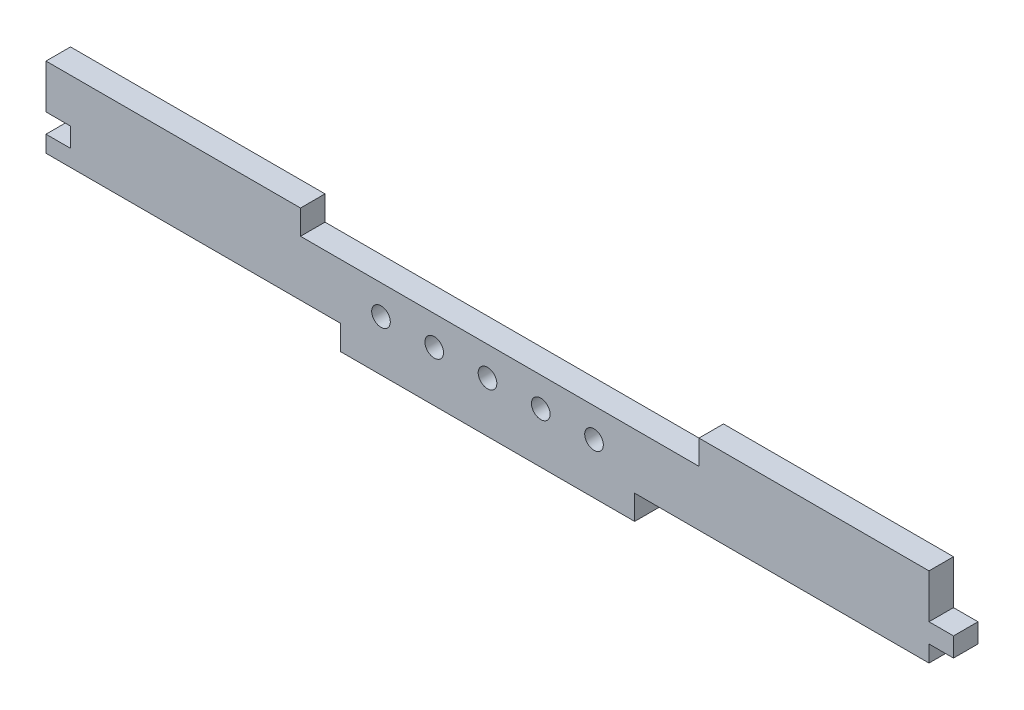
ISO-10303-21;
HEADER;
FILE_DESCRIPTION(('STEP AP214'),'2;1');
FILE_NAME('part.step','',(''),(''),'','','');
FILE_SCHEMA(('AUTOMOTIVE_DESIGN { 1 0 10303 214 1 1 1 1 }'));
ENDSEC;
DATA;
#1=APPLICATION_CONTEXT('core data for automotive mechanical design processes');
#2=APPLICATION_PROTOCOL_DEFINITION('international standard','automotive_design',2000,#1);
#3=PRODUCT_CONTEXT('',#1,'mechanical');
#4=PRODUCT('Part','Part','',(#3));
#5=PRODUCT_RELATED_PRODUCT_CATEGORY('part','',(#4));
#6=PRODUCT_DEFINITION_FORMATION('','',#4);
#7=PRODUCT_DEFINITION_CONTEXT('part definition',#1,'design');
#8=PRODUCT_DEFINITION('design','',#6,#7);
#9=PRODUCT_DEFINITION_SHAPE('','',#8);
#10=(LENGTH_UNIT() NAMED_UNIT(*) SI_UNIT(.MILLI.,.METRE.));
#11=(NAMED_UNIT(*) PLANE_ANGLE_UNIT() SI_UNIT($,.RADIAN.));
#12=(NAMED_UNIT(*) SI_UNIT($,.STERADIAN.) SOLID_ANGLE_UNIT());
#13=UNCERTAINTY_MEASURE_WITH_UNIT(LENGTH_MEASURE(1.E-05),#10,'distance_accuracy_value','');
#14=(GEOMETRIC_REPRESENTATION_CONTEXT(3) GLOBAL_UNCERTAINTY_ASSIGNED_CONTEXT((#13)) GLOBAL_UNIT_ASSIGNED_CONTEXT((#10,
#11,#12)) REPRESENTATION_CONTEXT('',''));
#15=CARTESIAN_POINT('',(0.,0.,0.));
#16=DIRECTION('',(0.,0.,1.));
#17=DIRECTION('',(1.,0.,0.));
#18=AXIS2_PLACEMENT_3D('',#15,#16,#17);
#19=CARTESIAN_POINT('',(0.,15.,4.6));
#20=DIRECTION('',(0.,-1.,0.));
#21=DIRECTION('',(0.,0.,-1.));
#22=AXIS2_PLACEMENT_3D('',#19,#20,#21);
#23=PLANE('',#22);
#24=DIRECTION('',(0.,0.,-1.));
#25=VECTOR('',#24,1.);
#26=CARTESIAN_POINT('',(47.7913014648267,15.,-1.55431223447522E-12));
#27=LINE('',#26,#25);
#28=CARTESIAN_POINT('',(47.7913014648267,15.,4.59999999999847));
#29=VERTEX_POINT('',#28);
#30=CARTESIAN_POINT('',(47.7913014648267,15.,-1.55431223447522E-12));
#31=VERTEX_POINT('',#30);
#32=EDGE_CURVE('E360',#29,#31,#27,.T.);
#33=ORIENTED_EDGE('',*,*,#32,.T.);
#34=DIRECTION('',(-1.,0.,0.));
#35=VECTOR('',#34,1.);
#36=CARTESIAN_POINT('',(0.,15.,0.));
#37=LINE('',#36,#35);
#38=CARTESIAN_POINT('',(0.,15.,0.));
#39=VERTEX_POINT('',#38);
#40=EDGE_CURVE('E214',#31,#39,#37,.T.);
#41=ORIENTED_EDGE('',*,*,#40,.T.);
#42=DIRECTION('',(0.,0.,-1.));
#43=VECTOR('',#42,1.);
#44=CARTESIAN_POINT('',(0.,15.,4.6));
#45=LINE('',#44,#43);
#46=CARTESIAN_POINT('',(0.,15.,4.6));
#47=VERTEX_POINT('',#46);
#48=EDGE_CURVE('E228',#47,#39,#45,.T.);
#49=ORIENTED_EDGE('',*,*,#48,.F.);
#50=DIRECTION('',(-1.,0.,0.));
#51=VECTOR('',#50,1.);
#52=CARTESIAN_POINT('',(0.,15.,4.6));
#53=LINE('',#52,#51);
#54=EDGE_CURVE('E301',#29,#47,#53,.T.);
#55=ORIENTED_EDGE('',*,*,#54,.F.);
#56=EDGE_LOOP('',(#33,#41,#49,#55));
#57=FACE_BOUND('',#56,.T.);
#58=ADVANCED_FACE('F31',(#57),#23,.F.);
#59=DIRECTION('',(0.,0.,1.));
#60=VECTOR('',#59,1.);
#61=CARTESIAN_POINT('',(122.608698535174,15.,-1.02695629777827E-12));
#62=LINE('',#61,#60);
#63=CARTESIAN_POINT('',(122.608698535174,15.,0.));
#64=VERTEX_POINT('',#63);
#65=CARTESIAN_POINT('',(122.608698535174,15.,4.59999999999897));
#66=VERTEX_POINT('',#65);
#67=EDGE_CURVE('E46',#64,#66,#62,.T.);
#68=ORIENTED_EDGE('',*,*,#67,.T.);
#69=CARTESIAN_POINT('',(165.8,15.,4.6));
#70=VERTEX_POINT('',#69);
#71=EDGE_CURVE('E302',#70,#66,#53,.T.);
#72=ORIENTED_EDGE('',*,*,#71,.F.);
#73=DIRECTION('',(0.,0.,-1.));
#74=VECTOR('',#73,1.);
#75=CARTESIAN_POINT('',(165.8,15.,4.6));
#76=LINE('',#75,#74);
#77=CARTESIAN_POINT('',(165.8,15.,0.));
#78=VERTEX_POINT('',#77);
#79=EDGE_CURVE('E231',#70,#78,#76,.T.);
#80=ORIENTED_EDGE('',*,*,#79,.T.);
#81=EDGE_CURVE('E215',#78,#64,#37,.T.);
#82=ORIENTED_EDGE('',*,*,#81,.T.);
#83=EDGE_LOOP('',(#68,#72,#80,#82));
#84=FACE_BOUND('',#83,.T.);
#85=ADVANCED_FACE('F390',(#84),#23,.F.);
#86=CARTESIAN_POINT('',(0.,3.10839082158942,4.6));
#87=DIRECTION('',(0.,0.,-1.));
#88=DIRECTION('',(-1.,0.,0.));
#89=AXIS2_PLACEMENT_3D('',#86,#87,#88);
#90=PLANE('',#89);
#91=CARTESIAN_POINT('',(62.9,4.9,4.6));
#92=DIRECTION('',(0.,0.,-1.));
#93=DIRECTION('',(-1.,0.,0.));
#94=AXIS2_PLACEMENT_3D('',#91,#92,#93);
#95=CIRCLE('',#94,1.75);
#96=CARTESIAN_POINT('',(61.15,4.9,4.6));
#97=VERTEX_POINT('',#96);
#98=EDGE_CURVE('E194',#97,#97,#95,.T.);
#99=ORIENTED_EDGE('',*,*,#98,.T.);
#100=EDGE_LOOP('',(#99));
#101=FACE_BOUND('',#100,.T.);
#102=CARTESIAN_POINT('',(102.9,4.89999999999986,4.6));
#103=DIRECTION('',(0.,0.,-1.));
#104=DIRECTION('',(-1.,0.,0.));
#105=AXIS2_PLACEMENT_3D('',#102,#103,#104);
#106=CIRCLE('',#105,1.75);
#107=CARTESIAN_POINT('',(101.15,4.89999999999986,4.6));
#108=VERTEX_POINT('',#107);
#109=EDGE_CURVE('E325',#108,#108,#106,.T.);
#110=ORIENTED_EDGE('',*,*,#109,.T.);
#111=EDGE_LOOP('',(#110));
#112=FACE_BOUND('',#111,.T.);
#113=CARTESIAN_POINT('',(82.9,4.9,4.6));
#114=DIRECTION('',(0.,0.,-1.));
#115=DIRECTION('',(-1.,0.,0.));
#116=AXIS2_PLACEMENT_3D('',#113,#114,#115);
#117=CIRCLE('',#116,1.75);
#118=CARTESIAN_POINT('',(81.15,4.9,4.6));
#119=VERTEX_POINT('',#118);
#120=EDGE_CURVE('E331',#119,#119,#117,.T.);
#121=ORIENTED_EDGE('',*,*,#120,.T.);
#122=EDGE_LOOP('',(#121));
#123=FACE_BOUND('',#122,.T.);
#124=CARTESIAN_POINT('',(72.9,4.9,4.6));
#125=DIRECTION('',(0.,0.,-1.));
#126=DIRECTION('',(-1.,0.,0.));
#127=AXIS2_PLACEMENT_3D('',#124,#125,#126);
#128=CIRCLE('',#127,1.75);
#129=CARTESIAN_POINT('',(71.15,4.9,4.6));
#130=VERTEX_POINT('',#129);
#131=EDGE_CURVE('E337',#130,#130,#128,.T.);
#132=ORIENTED_EDGE('',*,*,#131,.T.);
#133=EDGE_LOOP('',(#132));
#134=FACE_BOUND('',#133,.T.);
#135=CARTESIAN_POINT('',(92.9,4.89999999999993,4.6));
#136=DIRECTION('',(0.,0.,-1.));
#137=DIRECTION('',(-1.,0.,0.));
#138=AXIS2_PLACEMENT_3D('',#135,#136,#137);
#139=CIRCLE('',#138,1.75);
#140=CARTESIAN_POINT('',(91.15,4.89999999999993,4.6));
#141=VERTEX_POINT('',#140);
#142=EDGE_CURVE('E343',#141,#141,#139,.T.);
#143=ORIENTED_EDGE('',*,*,#142,.T.);
#144=EDGE_LOOP('',(#143));
#145=FACE_BOUND('',#144,.T.);
#146=DIRECTION('',(0.,1.,0.));
#147=VECTOR('',#146,1.);
#148=CARTESIAN_POINT('',(47.7913014648267,10.4,4.59999999999847));
#149=LINE('',#148,#147);
#150=CARTESIAN_POINT('',(47.7913014648267,10.4,4.59999999999847));
#151=VERTEX_POINT('',#150);
#152=EDGE_CURVE('E312',#151,#29,#149,.T.);
#153=ORIENTED_EDGE('',*,*,#152,.T.);
#154=ORIENTED_EDGE('',*,*,#54,.T.);
#155=DIRECTION('',(0.,-1.,0.));
#156=VECTOR('',#155,1.);
#157=CARTESIAN_POINT('',(0.,6.72272795381801,4.6));
#158=LINE('',#157,#156);
#159=CARTESIAN_POINT('',(0.,6.72272795381801,4.6));
#160=VERTEX_POINT('',#159);
#161=EDGE_CURVE('E169',#47,#160,#158,.T.);
#162=ORIENTED_EDGE('',*,*,#161,.T.);
#163=DIRECTION('',(1.,0.,0.));
#164=VECTOR('',#163,1.);
#165=CARTESIAN_POINT('',(0.,6.72272795381801,4.6));
#166=LINE('',#165,#164);
#167=CARTESIAN_POINT('',(4.6,6.72272795381801,4.6));
#168=VERTEX_POINT('',#167);
#169=EDGE_CURVE('E161',#160,#168,#166,.T.);
#170=ORIENTED_EDGE('',*,*,#169,.T.);
#171=DIRECTION('',(0.,-1.,0.));
#172=VECTOR('',#171,1.);
#173=CARTESIAN_POINT('',(4.6,3.10839082158942,4.6));
#174=LINE('',#173,#172);
#175=CARTESIAN_POINT('',(4.6,3.10839082158942,4.6));
#176=VERTEX_POINT('',#175);
#177=EDGE_CURVE('E166',#168,#176,#174,.T.);
#178=ORIENTED_EDGE('',*,*,#177,.T.);
#179=DIRECTION('',(-1.,0.,0.));
#180=VECTOR('',#179,1.);
#181=CARTESIAN_POINT('',(0.,3.10839082158942,4.6));
#182=LINE('',#181,#180);
#183=CARTESIAN_POINT('',(0.,3.10839082158942,4.6));
#184=VERTEX_POINT('',#183);
#185=EDGE_CURVE('E55',#176,#184,#182,.T.);
#186=ORIENTED_EDGE('',*,*,#185,.T.);
#187=DIRECTION('',(0.,-1.,0.));
#188=VECTOR('',#187,1.);
#189=CARTESIAN_POINT('',(0.,0.,4.6));
#190=LINE('',#189,#188);
#191=CARTESIAN_POINT('',(0.,0.,4.6));
#192=VERTEX_POINT('',#191);
#193=EDGE_CURVE('E224',#184,#192,#190,.T.);
#194=ORIENTED_EDGE('',*,*,#193,.T.);
#195=DIRECTION('',(1.,0.,0.));
#196=VECTOR('',#195,1.);
#197=CARTESIAN_POINT('',(0.,0.,4.6));
#198=LINE('',#197,#196);
#199=CARTESIAN_POINT('',(55.2666666666667,0.,4.6));
#200=VERTEX_POINT('',#199);
#201=EDGE_CURVE('E121',#192,#200,#198,.T.);
#202=ORIENTED_EDGE('',*,*,#201,.T.);
#203=DIRECTION('',(0.,-1.,0.));
#204=VECTOR('',#203,1.);
#205=CARTESIAN_POINT('',(55.2666666666667,0.,4.6));
#206=LINE('',#205,#204);
#207=CARTESIAN_POINT('',(55.2666666666667,-4.6,4.6));
#208=VERTEX_POINT('',#207);
#209=EDGE_CURVE('E283',#200,#208,#206,.T.);
#210=ORIENTED_EDGE('',*,*,#209,.T.);
#211=DIRECTION('',(1.,0.,0.));
#212=VECTOR('',#211,1.);
#213=CARTESIAN_POINT('',(55.2666666666667,-4.6,4.6));
#214=LINE('',#213,#212);
#215=CARTESIAN_POINT('',(110.533333333333,-4.6,4.6));
#216=VERTEX_POINT('',#215);
#217=EDGE_CURVE('E280',#208,#216,#214,.T.);
#218=ORIENTED_EDGE('',*,*,#217,.T.);
#219=DIRECTION('',(0.,1.,0.));
#220=VECTOR('',#219,1.);
#221=CARTESIAN_POINT('',(110.533333333333,0.,4.6));
#222=LINE('',#221,#220);
#223=CARTESIAN_POINT('',(110.533333333333,0.,4.6));
#224=VERTEX_POINT('',#223);
#225=EDGE_CURVE('E282',#216,#224,#222,.T.);
#226=ORIENTED_EDGE('',*,*,#225,.T.);
#227=DIRECTION('',(1.,0.,0.));
#228=VECTOR('',#227,1.);
#229=CARTESIAN_POINT('',(110.533333333333,0.,4.6));
#230=LINE('',#229,#228);
#231=CARTESIAN_POINT('',(165.8,0.,4.6));
#232=VERTEX_POINT('',#231);
#233=EDGE_CURVE('E285',#224,#232,#230,.T.);
#234=ORIENTED_EDGE('',*,*,#233,.T.);
#235=DIRECTION('',(0.,1.,0.));
#236=VECTOR('',#235,1.);
#237=CARTESIAN_POINT('',(165.8,0.,4.6));
#238=LINE('',#237,#236);
#239=CARTESIAN_POINT('',(165.8,3.10839082158942,4.6));
#240=VERTEX_POINT('',#239);
#241=EDGE_CURVE('E291',#232,#240,#238,.T.);
#242=ORIENTED_EDGE('',*,*,#241,.T.);
#243=DIRECTION('',(1.,0.,0.));
#244=VECTOR('',#243,1.);
#245=CARTESIAN_POINT('',(165.8,3.10839082158942,4.6));
#246=LINE('',#245,#244);
#247=CARTESIAN_POINT('',(170.4,3.10839082158942,4.6));
#248=VERTEX_POINT('',#247);
#249=EDGE_CURVE('E293',#240,#248,#246,.T.);
#250=ORIENTED_EDGE('',*,*,#249,.T.);
#251=DIRECTION('',(0.,1.,0.));
#252=VECTOR('',#251,1.);
#253=CARTESIAN_POINT('',(170.4,3.10839082158942,4.6));
#254=LINE('',#253,#252);
#255=CARTESIAN_POINT('',(170.4,6.72272795381801,4.6));
#256=VERTEX_POINT('',#255);
#257=EDGE_CURVE('E295',#248,#256,#254,.T.);
#258=ORIENTED_EDGE('',*,*,#257,.T.);
#259=DIRECTION('',(-1.,0.,0.));
#260=VECTOR('',#259,1.);
#261=CARTESIAN_POINT('',(165.8,6.72272795381801,4.6));
#262=LINE('',#261,#260);
#263=CARTESIAN_POINT('',(165.8,6.72272795381801,4.6));
#264=VERTEX_POINT('',#263);
#265=EDGE_CURVE('E297',#256,#264,#262,.T.);
#266=ORIENTED_EDGE('',*,*,#265,.T.);
#267=DIRECTION('',(0.,1.,0.));
#268=VECTOR('',#267,1.);
#269=CARTESIAN_POINT('',(165.8,6.72272795381801,4.6));
#270=LINE('',#269,#268);
#271=EDGE_CURVE('E299',#264,#70,#270,.T.);
#272=ORIENTED_EDGE('',*,*,#271,.T.);
#273=ORIENTED_EDGE('',*,*,#71,.T.);
#274=DIRECTION('',(0.,1.,0.));
#275=VECTOR('',#274,1.);
#276=CARTESIAN_POINT('',(122.608698535174,10.4,4.59999999999897));
#277=LINE('',#276,#275);
#278=CARTESIAN_POINT('',(122.608698535174,10.4,4.59999999999897));
#279=VERTEX_POINT('',#278);
#280=EDGE_CURVE('E354',#279,#66,#277,.T.);
#281=ORIENTED_EDGE('',*,*,#280,.F.);
#282=DIRECTION('',(-1.,0.,0.));
#283=VECTOR('',#282,1.);
#284=CARTESIAN_POINT('',(122.608698535174,10.4,4.59999999999897));
#285=LINE('',#284,#283);
#286=EDGE_CURVE('E366',#279,#151,#285,.T.);
#287=ORIENTED_EDGE('',*,*,#286,.T.);
#288=EDGE_LOOP('',(#153,#154,#162,#170,#178,#186,#194,#202,#210,#218,#226,#234,#242,#250,#258,
#266,#272,#273,#281,#287));
#289=FACE_BOUND('',#288,.T.);
#290=ADVANCED_FACE('F164',(#101,#112,#123,#134,#145,#289),#90,.F.);
#291=CARTESIAN_POINT('',(0.,3.10839082158942,0.));
#292=DIRECTION('',(0.,0.,-1.));
#293=DIRECTION('',(-1.,0.,0.));
#294=AXIS2_PLACEMENT_3D('',#291,#292,#293);
#295=PLANE('',#294);
#296=DIRECTION('',(-1.,0.,0.));
#297=VECTOR('',#296,1.);
#298=CARTESIAN_POINT('',(0.,10.4,0.));
#299=LINE('',#298,#297);
#300=CARTESIAN_POINT('',(122.608698535174,10.4,-1.02695629777827E-12));
#301=VERTEX_POINT('',#300);
#302=CARTESIAN_POINT('',(47.7913014648267,10.4,-1.55431223447522E-12));
#303=VERTEX_POINT('',#302);
#304=EDGE_CURVE('E11',#301,#303,#299,.T.);
#305=ORIENTED_EDGE('',*,*,#304,.F.);
#306=DIRECTION('',(0.,1.,0.));
#307=VECTOR('',#306,1.);
#308=CARTESIAN_POINT('',(122.608698535174,10.4,-1.02695629777827E-12));
#309=LINE('',#308,#307);
#310=EDGE_CURVE('E352',#301,#64,#309,.T.);
#311=ORIENTED_EDGE('',*,*,#310,.T.);
#312=ORIENTED_EDGE('',*,*,#81,.F.);
#313=DIRECTION('',(0.,1.,0.));
#314=VECTOR('',#313,1.);
#315=CARTESIAN_POINT('',(165.8,6.72272795381801,0.));
#316=LINE('',#315,#314);
#317=CARTESIAN_POINT('',(165.8,6.72272795381801,0.));
#318=VERTEX_POINT('',#317);
#319=EDGE_CURVE('E212',#318,#78,#316,.T.);
#320=ORIENTED_EDGE('',*,*,#319,.F.);
#321=DIRECTION('',(-1.,0.,0.));
#322=VECTOR('',#321,1.);
#323=CARTESIAN_POINT('',(165.8,6.72272795381801,0.));
#324=LINE('',#323,#322);
#325=CARTESIAN_POINT('',(170.4,6.72272795381801,0.));
#326=VERTEX_POINT('',#325);
#327=EDGE_CURVE('E210',#326,#318,#324,.T.);
#328=ORIENTED_EDGE('',*,*,#327,.F.);
#329=DIRECTION('',(0.,1.,0.));
#330=VECTOR('',#329,1.);
#331=CARTESIAN_POINT('',(170.4,3.10839082158942,0.));
#332=LINE('',#331,#330);
#333=CARTESIAN_POINT('',(170.4,3.10839082158942,0.));
#334=VERTEX_POINT('',#333);
#335=EDGE_CURVE('E208',#334,#326,#332,.T.);
#336=ORIENTED_EDGE('',*,*,#335,.F.);
#337=DIRECTION('',(1.,0.,0.));
#338=VECTOR('',#337,1.);
#339=CARTESIAN_POINT('',(165.8,3.10839082158942,0.));
#340=LINE('',#339,#338);
#341=CARTESIAN_POINT('',(165.8,3.10839082158942,0.));
#342=VERTEX_POINT('',#341);
#343=EDGE_CURVE('E206',#342,#334,#340,.T.);
#344=ORIENTED_EDGE('',*,*,#343,.F.);
#345=DIRECTION('',(0.,1.,0.));
#346=VECTOR('',#345,1.);
#347=CARTESIAN_POINT('',(165.8,0.,0.));
#348=LINE('',#347,#346);
#349=CARTESIAN_POINT('',(165.8,0.,0.));
#350=VERTEX_POINT('',#349);
#351=EDGE_CURVE('E204',#350,#342,#348,.T.);
#352=ORIENTED_EDGE('',*,*,#351,.F.);
#353=DIRECTION('',(1.,0.,0.));
#354=VECTOR('',#353,1.);
#355=CARTESIAN_POINT('',(110.533333333333,0.,0.));
#356=LINE('',#355,#354);
#357=CARTESIAN_POINT('',(110.533333333333,0.,0.));
#358=VERTEX_POINT('',#357);
#359=EDGE_CURVE('E202',#358,#350,#356,.T.);
#360=ORIENTED_EDGE('',*,*,#359,.F.);
#361=DIRECTION('',(0.,1.,0.));
#362=VECTOR('',#361,1.);
#363=CARTESIAN_POINT('',(110.533333333333,0.,0.));
#364=LINE('',#363,#362);
#365=CARTESIAN_POINT('',(110.533333333333,-4.6,0.));
#366=VERTEX_POINT('',#365);
#367=EDGE_CURVE('E200',#366,#358,#364,.T.);
#368=ORIENTED_EDGE('',*,*,#367,.F.);
#369=DIRECTION('',(1.,0.,0.));
#370=VECTOR('',#369,1.);
#371=CARTESIAN_POINT('',(55.2666666666667,-4.6,0.));
#372=LINE('',#371,#370);
#373=CARTESIAN_POINT('',(55.2666666666667,-4.6,0.));
#374=VERTEX_POINT('',#373);
#375=EDGE_CURVE('E198',#374,#366,#372,.T.);
#376=ORIENTED_EDGE('',*,*,#375,.F.);
#377=DIRECTION('',(0.,-1.,0.));
#378=VECTOR('',#377,1.);
#379=CARTESIAN_POINT('',(55.2666666666667,0.,0.));
#380=LINE('',#379,#378);
#381=CARTESIAN_POINT('',(55.2666666666667,0.,0.));
#382=VERTEX_POINT('',#381);
#383=EDGE_CURVE('E196',#382,#374,#380,.T.);
#384=ORIENTED_EDGE('',*,*,#383,.F.);
#385=DIRECTION('',(1.,0.,0.));
#386=VECTOR('',#385,1.);
#387=CARTESIAN_POINT('',(0.,0.,0.));
#388=LINE('',#387,#386);
#389=CARTESIAN_POINT('',(0.,0.,0.));
#390=VERTEX_POINT('',#389);
#391=EDGE_CURVE('E193',#390,#382,#388,.T.);
#392=ORIENTED_EDGE('',*,*,#391,.F.);
#393=DIRECTION('',(0.,-1.,0.));
#394=VECTOR('',#393,1.);
#395=CARTESIAN_POINT('',(0.,0.,0.));
#396=LINE('',#395,#394);
#397=CARTESIAN_POINT('',(0.,3.10839082158942,0.));
#398=VERTEX_POINT('',#397);
#399=EDGE_CURVE('E190',#398,#390,#396,.T.);
#400=ORIENTED_EDGE('',*,*,#399,.F.);
#401=DIRECTION('',(-1.,0.,0.));
#402=VECTOR('',#401,1.);
#403=CARTESIAN_POINT('',(0.,3.10839082158942,0.));
#404=LINE('',#403,#402);
#405=CARTESIAN_POINT('',(4.6,3.10839082158942,0.));
#406=VERTEX_POINT('',#405);
#407=EDGE_CURVE('E112',#406,#398,#404,.T.);
#408=ORIENTED_EDGE('',*,*,#407,.F.);
#409=DIRECTION('',(0.,-1.,0.));
#410=VECTOR('',#409,1.);
#411=CARTESIAN_POINT('',(4.6,3.10839082158942,0.));
#412=LINE('',#411,#410);
#413=CARTESIAN_POINT('',(4.6,6.72272795381801,0.));
#414=VERTEX_POINT('',#413);
#415=EDGE_CURVE('E221',#414,#406,#412,.T.);
#416=ORIENTED_EDGE('',*,*,#415,.F.);
#417=DIRECTION('',(1.,0.,0.));
#418=VECTOR('',#417,1.);
#419=CARTESIAN_POINT('',(0.,6.72272795381801,0.));
#420=LINE('',#419,#418);
#421=CARTESIAN_POINT('',(0.,6.72272795381801,0.));
#422=VERTEX_POINT('',#421);
#423=EDGE_CURVE('E178',#422,#414,#420,.T.);
#424=ORIENTED_EDGE('',*,*,#423,.F.);
#425=DIRECTION('',(0.,-1.,0.));
#426=VECTOR('',#425,1.);
#427=CARTESIAN_POINT('',(0.,6.72272795381801,0.));
#428=LINE('',#427,#426);
#429=EDGE_CURVE('E218',#39,#422,#428,.T.);
#430=ORIENTED_EDGE('',*,*,#429,.F.);
#431=ORIENTED_EDGE('',*,*,#40,.F.);
#432=DIRECTION('',(0.,1.,0.));
#433=VECTOR('',#432,1.);
#434=CARTESIAN_POINT('',(47.7913014648267,10.4,-1.55431223447522E-12));
#435=LINE('',#434,#433);
#436=EDGE_CURVE('E349',#303,#31,#435,.T.);
#437=ORIENTED_EDGE('',*,*,#436,.F.);
#438=EDGE_LOOP('',(#305,#311,#312,#320,#328,#336,#344,#352,#360,#368,#376,#384,#392,#400,#408,
#416,#424,#430,#431,#437));
#439=FACE_BOUND('',#438,.T.);
#440=CARTESIAN_POINT('',(62.9,4.9,0.));
#441=DIRECTION('',(0.,0.,-1.));
#442=DIRECTION('',(-1.,0.,0.));
#443=AXIS2_PLACEMENT_3D('',#440,#441,#442);
#444=CIRCLE('',#443,1.75);
#445=CARTESIAN_POINT('',(61.15,4.9,0.));
#446=VERTEX_POINT('',#445);
#447=EDGE_CURVE('E322',#446,#446,#444,.T.);
#448=ORIENTED_EDGE('',*,*,#447,.F.);
#449=EDGE_LOOP('',(#448));
#450=FACE_BOUND('',#449,.T.);
#451=CARTESIAN_POINT('',(102.9,4.89999999999986,0.));
#452=DIRECTION('',(0.,0.,-1.));
#453=DIRECTION('',(-1.,0.,0.));
#454=AXIS2_PLACEMENT_3D('',#451,#452,#453);
#455=CIRCLE('',#454,1.75);
#456=CARTESIAN_POINT('',(101.15,4.89999999999986,0.));
#457=VERTEX_POINT('',#456);
#458=EDGE_CURVE('E328',#457,#457,#455,.T.);
#459=ORIENTED_EDGE('',*,*,#458,.F.);
#460=EDGE_LOOP('',(#459));
#461=FACE_BOUND('',#460,.T.);
#462=CARTESIAN_POINT('',(82.9,4.9,0.));
#463=DIRECTION('',(0.,0.,-1.));
#464=DIRECTION('',(-1.,0.,0.));
#465=AXIS2_PLACEMENT_3D('',#462,#463,#464);
#466=CIRCLE('',#465,1.75);
#467=CARTESIAN_POINT('',(81.15,4.9,0.));
#468=VERTEX_POINT('',#467);
#469=EDGE_CURVE('E334',#468,#468,#466,.T.);
#470=ORIENTED_EDGE('',*,*,#469,.F.);
#471=EDGE_LOOP('',(#470));
#472=FACE_BOUND('',#471,.T.);
#473=CARTESIAN_POINT('',(72.9,4.9,0.));
#474=DIRECTION('',(0.,0.,-1.));
#475=DIRECTION('',(-1.,0.,0.));
#476=AXIS2_PLACEMENT_3D('',#473,#474,#475);
#477=CIRCLE('',#476,1.75);
#478=CARTESIAN_POINT('',(71.15,4.9,0.));
#479=VERTEX_POINT('',#478);
#480=EDGE_CURVE('E340',#479,#479,#477,.T.);
#481=ORIENTED_EDGE('',*,*,#480,.F.);
#482=EDGE_LOOP('',(#481));
#483=FACE_BOUND('',#482,.T.);
#484=CARTESIAN_POINT('',(92.9,4.89999999999993,0.));
#485=DIRECTION('',(0.,0.,-1.));
#486=DIRECTION('',(-1.,0.,0.));
#487=AXIS2_PLACEMENT_3D('',#484,#485,#486);
#488=CIRCLE('',#487,1.75);
#489=CARTESIAN_POINT('',(91.15,4.89999999999993,0.));
#490=VERTEX_POINT('',#489);
#491=EDGE_CURVE('E346',#490,#490,#488,.T.);
#492=ORIENTED_EDGE('',*,*,#491,.F.);
#493=EDGE_LOOP('',(#492));
#494=FACE_BOUND('',#493,.T.);
#495=ADVANCED_FACE('F267',(#439,#450,#461,#472,#483,#494),#295,.T.);
#496=CARTESIAN_POINT('',(0.,0.,4.6));
#497=DIRECTION('',(1.,0.,0.));
#498=DIRECTION('',(0.,0.,-1.));
#499=AXIS2_PLACEMENT_3D('',#496,#497,#498);
#500=PLANE('',#499);
#501=ORIENTED_EDGE('',*,*,#399,.T.);
#502=DIRECTION('',(0.,0.,-1.));
#503=VECTOR('',#502,1.);
#504=CARTESIAN_POINT('',(0.,0.,4.6));
#505=LINE('',#504,#503);
#506=EDGE_CURVE('E39',#192,#390,#505,.T.);
#507=ORIENTED_EDGE('',*,*,#506,.F.);
#508=ORIENTED_EDGE('',*,*,#193,.F.);
#509=DIRECTION('',(0.,0.,-1.));
#510=VECTOR('',#509,1.);
#511=CARTESIAN_POINT('',(0.,3.10839082158942,4.6));
#512=LINE('',#511,#510);
#513=EDGE_CURVE('E186',#184,#398,#512,.T.);
#514=ORIENTED_EDGE('',*,*,#513,.T.);
#515=EDGE_LOOP('',(#501,#507,#508,#514));
#516=FACE_BOUND('',#515,.T.);
#517=ADVANCED_FACE('F33',(#516),#500,.F.);
#518=CARTESIAN_POINT('',(0.,0.,4.6));
#519=DIRECTION('',(0.,1.,0.));
#520=DIRECTION('',(0.,0.,1.));
#521=AXIS2_PLACEMENT_3D('',#518,#519,#520);
#522=PLANE('',#521);
#523=ORIENTED_EDGE('',*,*,#391,.T.);
#524=DIRECTION('',(0.,0.,-1.));
#525=VECTOR('',#524,1.);
#526=CARTESIAN_POINT('',(55.2666666666667,0.,4.6));
#527=LINE('',#526,#525);
#528=EDGE_CURVE('E258',#200,#382,#527,.T.);
#529=ORIENTED_EDGE('',*,*,#528,.F.);
#530=ORIENTED_EDGE('',*,*,#201,.F.);
#531=ORIENTED_EDGE('',*,*,#506,.T.);
#532=EDGE_LOOP('',(#523,#529,#530,#531));
#533=FACE_BOUND('',#532,.T.);
#534=ADVANCED_FACE('F261',(#533),#522,.F.);
#535=CARTESIAN_POINT('',(55.2666666666667,0.,4.6));
#536=DIRECTION('',(1.,0.,0.));
#537=DIRECTION('',(0.,0.,-1.));
#538=AXIS2_PLACEMENT_3D('',#535,#536,#537);
#539=PLANE('',#538);
#540=ORIENTED_EDGE('',*,*,#383,.T.);
#541=DIRECTION('',(0.,0.,-1.));
#542=VECTOR('',#541,1.);
#543=CARTESIAN_POINT('',(55.2666666666667,-4.6,4.6));
#544=LINE('',#543,#542);
#545=EDGE_CURVE('E255',#208,#374,#544,.T.);
#546=ORIENTED_EDGE('',*,*,#545,.F.);
#547=ORIENTED_EDGE('',*,*,#209,.F.);
#548=ORIENTED_EDGE('',*,*,#528,.T.);
#549=EDGE_LOOP('',(#540,#546,#547,#548));
#550=FACE_BOUND('',#549,.T.);
#551=ADVANCED_FACE('F274',(#550),#539,.F.);
#552=CARTESIAN_POINT('',(55.2666666666667,-4.6,4.6));
#553=DIRECTION('',(0.,1.,0.));
#554=DIRECTION('',(0.,0.,1.));
#555=AXIS2_PLACEMENT_3D('',#552,#553,#554);
#556=PLANE('',#555);
#557=ORIENTED_EDGE('',*,*,#375,.T.);
#558=DIRECTION('',(0.,0.,-1.));
#559=VECTOR('',#558,1.);
#560=CARTESIAN_POINT('',(110.533333333333,-4.6,4.6));
#561=LINE('',#560,#559);
#562=EDGE_CURVE('E252',#216,#366,#561,.T.);
#563=ORIENTED_EDGE('',*,*,#562,.F.);
#564=ORIENTED_EDGE('',*,*,#217,.F.);
#565=ORIENTED_EDGE('',*,*,#545,.T.);
#566=EDGE_LOOP('',(#557,#563,#564,#565));
#567=FACE_BOUND('',#566,.T.);
#568=ADVANCED_FACE('F278',(#567),#556,.F.);
#569=CARTESIAN_POINT('',(110.533333333333,0.,4.6));
#570=DIRECTION('',(-1.,0.,0.));
#571=DIRECTION('',(0.,-1.,0.));
#572=AXIS2_PLACEMENT_3D('',#569,#570,#571);
#573=PLANE('',#572);
#574=ORIENTED_EDGE('',*,*,#367,.T.);
#575=DIRECTION('',(0.,0.,-1.));
#576=VECTOR('',#575,1.);
#577=CARTESIAN_POINT('',(110.533333333333,0.,4.6));
#578=LINE('',#577,#576);
#579=EDGE_CURVE('E249',#224,#358,#578,.T.);
#580=ORIENTED_EDGE('',*,*,#579,.F.);
#581=ORIENTED_EDGE('',*,*,#225,.F.);
#582=ORIENTED_EDGE('',*,*,#562,.T.);
#583=EDGE_LOOP('',(#574,#580,#581,#582));
#584=FACE_BOUND('',#583,.T.);
#585=ADVANCED_FACE('F422',(#584),#573,.F.);
#586=CARTESIAN_POINT('',(110.533333333333,0.,4.6));
#587=DIRECTION('',(0.,1.,0.));
#588=DIRECTION('',(0.,0.,1.));
#589=AXIS2_PLACEMENT_3D('',#586,#587,#588);
#590=PLANE('',#589);
#591=ORIENTED_EDGE('',*,*,#359,.T.);
#592=DIRECTION('',(0.,0.,-1.));
#593=VECTOR('',#592,1.);
#594=CARTESIAN_POINT('',(165.8,0.,4.6));
#595=LINE('',#594,#593);
#596=EDGE_CURVE('E246',#232,#350,#595,.T.);
#597=ORIENTED_EDGE('',*,*,#596,.F.);
#598=ORIENTED_EDGE('',*,*,#233,.F.);
#599=ORIENTED_EDGE('',*,*,#579,.T.);
#600=EDGE_LOOP('',(#591,#597,#598,#599));
#601=FACE_BOUND('',#600,.T.);
#602=ADVANCED_FACE('F419',(#601),#590,.F.);
#603=CARTESIAN_POINT('',(165.8,0.,4.6));
#604=DIRECTION('',(-1.,0.,0.));
#605=DIRECTION('',(0.,0.,1.));
#606=AXIS2_PLACEMENT_3D('',#603,#604,#605);
#607=PLANE('',#606);
#608=ORIENTED_EDGE('',*,*,#351,.T.);
#609=DIRECTION('',(0.,0.,-1.));
#610=VECTOR('',#609,1.);
#611=CARTESIAN_POINT('',(165.8,3.10839082158942,4.6));
#612=LINE('',#611,#610);
#613=EDGE_CURVE('E243',#240,#342,#612,.T.);
#614=ORIENTED_EDGE('',*,*,#613,.F.);
#615=ORIENTED_EDGE('',*,*,#241,.F.);
#616=ORIENTED_EDGE('',*,*,#596,.T.);
#617=EDGE_LOOP('',(#608,#614,#615,#616));
#618=FACE_BOUND('',#617,.T.);
#619=ADVANCED_FACE('F414',(#618),#607,.F.);
#620=CARTESIAN_POINT('',(165.8,3.10839082158942,4.6));
#621=DIRECTION('',(0.,1.,0.));
#622=DIRECTION('',(0.,0.,1.));
#623=AXIS2_PLACEMENT_3D('',#620,#621,#622);
#624=PLANE('',#623);
#625=ORIENTED_EDGE('',*,*,#343,.T.);
#626=DIRECTION('',(0.,0.,-1.));
#627=VECTOR('',#626,1.);
#628=CARTESIAN_POINT('',(170.4,3.10839082158942,4.6));
#629=LINE('',#628,#627);
#630=EDGE_CURVE('E240',#248,#334,#629,.T.);
#631=ORIENTED_EDGE('',*,*,#630,.F.);
#632=ORIENTED_EDGE('',*,*,#249,.F.);
#633=ORIENTED_EDGE('',*,*,#613,.T.);
#634=EDGE_LOOP('',(#625,#631,#632,#633));
#635=FACE_BOUND('',#634,.T.);
#636=ADVANCED_FACE('F409',(#635),#624,.F.);
#637=CARTESIAN_POINT('',(170.4,3.10839082158942,4.6));
#638=DIRECTION('',(-1.,0.,0.));
#639=DIRECTION('',(0.,0.,1.));
#640=AXIS2_PLACEMENT_3D('',#637,#638,#639);
#641=PLANE('',#640);
#642=ORIENTED_EDGE('',*,*,#335,.T.);
#643=DIRECTION('',(0.,0.,-1.));
#644=VECTOR('',#643,1.);
#645=CARTESIAN_POINT('',(170.4,6.72272795381801,4.6));
#646=LINE('',#645,#644);
#647=EDGE_CURVE('E237',#256,#326,#646,.T.);
#648=ORIENTED_EDGE('',*,*,#647,.F.);
#649=ORIENTED_EDGE('',*,*,#257,.F.);
#650=ORIENTED_EDGE('',*,*,#630,.T.);
#651=EDGE_LOOP('',(#642,#648,#649,#650));
#652=FACE_BOUND('',#651,.T.);
#653=ADVANCED_FACE('F405',(#652),#641,.F.);
#654=CARTESIAN_POINT('',(165.8,6.72272795381801,4.6));
#655=DIRECTION('',(0.,-1.,0.));
#656=DIRECTION('',(0.,0.,-1.));
#657=AXIS2_PLACEMENT_3D('',#654,#655,#656);
#658=PLANE('',#657);
#659=ORIENTED_EDGE('',*,*,#327,.T.);
#660=DIRECTION('',(0.,0.,-1.));
#661=VECTOR('',#660,1.);
#662=CARTESIAN_POINT('',(165.8,6.72272795381801,4.6));
#663=LINE('',#662,#661);
#664=EDGE_CURVE('E234',#264,#318,#663,.T.);
#665=ORIENTED_EDGE('',*,*,#664,.F.);
#666=ORIENTED_EDGE('',*,*,#265,.F.);
#667=ORIENTED_EDGE('',*,*,#647,.T.);
#668=EDGE_LOOP('',(#659,#665,#666,#667));
#669=FACE_BOUND('',#668,.T.);
#670=ADVANCED_FACE('F400',(#669),#658,.F.);
#671=CARTESIAN_POINT('',(165.8,6.72272795381801,4.6));
#672=DIRECTION('',(-1.,0.,0.));
#673=DIRECTION('',(0.,0.,1.));
#674=AXIS2_PLACEMENT_3D('',#671,#672,#673);
#675=PLANE('',#674);
#676=ORIENTED_EDGE('',*,*,#319,.T.);
#677=ORIENTED_EDGE('',*,*,#79,.F.);
#678=ORIENTED_EDGE('',*,*,#271,.F.);
#679=ORIENTED_EDGE('',*,*,#664,.T.);
#680=EDGE_LOOP('',(#676,#677,#678,#679));
#681=FACE_BOUND('',#680,.T.);
#682=ADVANCED_FACE('F394',(#681),#675,.F.);
#683=CARTESIAN_POINT('',(0.,6.72272795381801,4.6));
#684=DIRECTION('',(1.,0.,0.));
#685=DIRECTION('',(0.,0.,-1.));
#686=AXIS2_PLACEMENT_3D('',#683,#684,#685);
#687=PLANE('',#686);
#688=DIRECTION('',(0.,0.,-1.));
#689=VECTOR('',#688,1.);
#690=CARTESIAN_POINT('',(0.,6.72272795381801,4.6));
#691=LINE('',#690,#689);
#692=EDGE_CURVE('E181',#160,#422,#691,.T.);
#693=ORIENTED_EDGE('',*,*,#692,.F.);
#694=ORIENTED_EDGE('',*,*,#161,.F.);
#695=ORIENTED_EDGE('',*,*,#48,.T.);
#696=ORIENTED_EDGE('',*,*,#429,.T.);
#697=EDGE_LOOP('',(#693,#694,#695,#696));
#698=FACE_BOUND('',#697,.T.);
#699=ADVANCED_FACE('F318',(#698),#687,.F.);
#700=CARTESIAN_POINT('',(0.,6.72272795381801,4.6));
#701=DIRECTION('',(0.,1.,0.));
#702=DIRECTION('',(0.,0.,1.));
#703=AXIS2_PLACEMENT_3D('',#700,#701,#702);
#704=PLANE('',#703);
#705=ORIENTED_EDGE('',*,*,#423,.T.);
#706=DIRECTION('',(0.,0.,-1.));
#707=VECTOR('',#706,1.);
#708=CARTESIAN_POINT('',(4.6,6.72272795381801,4.6));
#709=LINE('',#708,#707);
#710=EDGE_CURVE('E175',#168,#414,#709,.T.);
#711=ORIENTED_EDGE('',*,*,#710,.F.);
#712=ORIENTED_EDGE('',*,*,#169,.F.);
#713=ORIENTED_EDGE('',*,*,#692,.T.);
#714=EDGE_LOOP('',(#705,#711,#712,#713));
#715=FACE_BOUND('',#714,.T.);
#716=ADVANCED_FACE('F176',(#715),#704,.F.);
#717=CARTESIAN_POINT('',(4.6,3.10839082158942,4.6));
#718=DIRECTION('',(1.,0.,0.));
#719=DIRECTION('',(0.,0.,-1.));
#720=AXIS2_PLACEMENT_3D('',#717,#718,#719);
#721=PLANE('',#720);
#722=ORIENTED_EDGE('',*,*,#415,.T.);
#723=DIRECTION('',(0.,0.,-1.));
#724=VECTOR('',#723,1.);
#725=CARTESIAN_POINT('',(4.6,3.10839082158942,4.6));
#726=LINE('',#725,#724);
#727=EDGE_CURVE('E182',#176,#406,#726,.T.);
#728=ORIENTED_EDGE('',*,*,#727,.F.);
#729=ORIENTED_EDGE('',*,*,#177,.F.);
#730=ORIENTED_EDGE('',*,*,#710,.T.);
#731=EDGE_LOOP('',(#722,#728,#729,#730));
#732=FACE_BOUND('',#731,.T.);
#733=ADVANCED_FACE('F184',(#732),#721,.F.);
#734=CARTESIAN_POINT('',(0.,3.10839082158942,4.6));
#735=DIRECTION('',(0.,-1.,0.));
#736=DIRECTION('',(0.,0.,-1.));
#737=AXIS2_PLACEMENT_3D('',#734,#735,#736);
#738=PLANE('',#737);
#739=ORIENTED_EDGE('',*,*,#407,.T.);
#740=ORIENTED_EDGE('',*,*,#513,.F.);
#741=ORIENTED_EDGE('',*,*,#185,.F.);
#742=ORIENTED_EDGE('',*,*,#727,.T.);
#743=EDGE_LOOP('',(#739,#740,#741,#742));
#744=FACE_BOUND('',#743,.T.);
#745=ADVANCED_FACE('F319',(#744),#738,.F.);
#746=CARTESIAN_POINT('',(62.9,4.9,4.6));
#747=DIRECTION('',(0.,0.,-1.));
#748=DIRECTION('',(-1.,0.,0.));
#749=AXIS2_PLACEMENT_3D('',#746,#747,#748);
#750=CYLINDRICAL_SURFACE('',#749,1.75);
#751=ORIENTED_EDGE('',*,*,#98,.F.);
#752=EDGE_LOOP('',(#751));
#753=FACE_BOUND('',#752,.T.);
#754=ORIENTED_EDGE('',*,*,#447,.T.);
#755=EDGE_LOOP('',(#754));
#756=FACE_BOUND('',#755,.T.);
#757=ADVANCED_FACE('F493',(#753,#756),#750,.F.);
#758=CARTESIAN_POINT('',(102.9,4.89999999999986,4.6));
#759=DIRECTION('',(0.,0.,-1.));
#760=DIRECTION('',(-1.,0.,0.));
#761=AXIS2_PLACEMENT_3D('',#758,#759,#760);
#762=CYLINDRICAL_SURFACE('',#761,1.75);
#763=ORIENTED_EDGE('',*,*,#109,.F.);
#764=EDGE_LOOP('',(#763));
#765=FACE_BOUND('',#764,.T.);
#766=ORIENTED_EDGE('',*,*,#458,.T.);
#767=EDGE_LOOP('',(#766));
#768=FACE_BOUND('',#767,.T.);
#769=ADVANCED_FACE('F500',(#765,#768),#762,.F.);
#770=CARTESIAN_POINT('',(82.9,4.9,4.6));
#771=DIRECTION('',(0.,0.,-1.));
#772=DIRECTION('',(-1.,0.,0.));
#773=AXIS2_PLACEMENT_3D('',#770,#771,#772);
#774=CYLINDRICAL_SURFACE('',#773,1.75);
#775=ORIENTED_EDGE('',*,*,#120,.F.);
#776=EDGE_LOOP('',(#775));
#777=FACE_BOUND('',#776,.T.);
#778=ORIENTED_EDGE('',*,*,#469,.T.);
#779=EDGE_LOOP('',(#778));
#780=FACE_BOUND('',#779,.T.);
#781=ADVANCED_FACE('F508',(#777,#780),#774,.F.);
#782=CARTESIAN_POINT('',(72.9,4.9,4.6));
#783=DIRECTION('',(0.,0.,-1.));
#784=DIRECTION('',(-1.,0.,0.));
#785=AXIS2_PLACEMENT_3D('',#782,#783,#784);
#786=CYLINDRICAL_SURFACE('',#785,1.75);
#787=ORIENTED_EDGE('',*,*,#131,.F.);
#788=EDGE_LOOP('',(#787));
#789=FACE_BOUND('',#788,.T.);
#790=ORIENTED_EDGE('',*,*,#480,.T.);
#791=EDGE_LOOP('',(#790));
#792=FACE_BOUND('',#791,.T.);
#793=ADVANCED_FACE('F516',(#789,#792),#786,.F.);
#794=CARTESIAN_POINT('',(92.9,4.89999999999993,4.6));
#795=DIRECTION('',(0.,0.,-1.));
#796=DIRECTION('',(-1.,0.,0.));
#797=AXIS2_PLACEMENT_3D('',#794,#795,#796);
#798=CYLINDRICAL_SURFACE('',#797,1.75);
#799=ORIENTED_EDGE('',*,*,#142,.F.);
#800=EDGE_LOOP('',(#799));
#801=FACE_BOUND('',#800,.T.);
#802=ORIENTED_EDGE('',*,*,#491,.T.);
#803=EDGE_LOOP('',(#802));
#804=FACE_BOUND('',#803,.T.);
#805=ADVANCED_FACE('F524',(#801,#804),#798,.F.);
#806=CARTESIAN_POINT('',(182.9,10.4,-12.5000000000013));
#807=DIRECTION('',(0.,-1.,0.));
#808=DIRECTION('',(0.,0.,-1.));
#809=AXIS2_PLACEMENT_3D('',#806,#807,#808);
#810=PLANE('',#809);
#811=ORIENTED_EDGE('',*,*,#304,.T.);
#812=DIRECTION('',(0.,0.,-1.));
#813=VECTOR('',#812,1.);
#814=CARTESIAN_POINT('',(47.7913014648267,10.4,-1.55431223447522E-12));
#815=LINE('',#814,#813);
#816=EDGE_CURVE('E355',#151,#303,#815,.T.);
#817=ORIENTED_EDGE('',*,*,#816,.F.);
#818=ORIENTED_EDGE('',*,*,#286,.F.);
#819=DIRECTION('',(0.,0.,1.));
#820=VECTOR('',#819,1.);
#821=CARTESIAN_POINT('',(122.608698535174,10.4,-1.02695629777827E-12));
#822=LINE('',#821,#820);
#823=EDGE_CURVE('E362',#301,#279,#822,.T.);
#824=ORIENTED_EDGE('',*,*,#823,.F.);
#825=EDGE_LOOP('',(#811,#817,#818,#824));
#826=FACE_BOUND('',#825,.T.);
#827=ADVANCED_FACE('F379',(#826),#810,.F.);
#828=CARTESIAN_POINT('',(47.7913014648267,10.4,-1.55431223447522E-12));
#829=DIRECTION('',(1.,0.,0.));
#830=DIRECTION('',(0.,0.,1.));
#831=AXIS2_PLACEMENT_3D('',#828,#829,#830);
#832=PLANE('',#831);
#833=ORIENTED_EDGE('',*,*,#32,.F.);
#834=ORIENTED_EDGE('',*,*,#152,.F.);
#835=ORIENTED_EDGE('',*,*,#816,.T.);
#836=ORIENTED_EDGE('',*,*,#436,.T.);
#837=EDGE_LOOP('',(#833,#834,#835,#836));
#838=FACE_BOUND('',#837,.T.);
#839=ADVANCED_FACE('F383',(#838),#832,.T.);
#840=CARTESIAN_POINT('',(122.608698535174,10.4,-1.02695629777827E-12));
#841=DIRECTION('',(-1.,0.,0.));
#842=DIRECTION('',(0.,0.,-1.));
#843=AXIS2_PLACEMENT_3D('',#840,#841,#842);
#844=PLANE('',#843);
#845=ORIENTED_EDGE('',*,*,#67,.F.);
#846=ORIENTED_EDGE('',*,*,#310,.F.);
#847=ORIENTED_EDGE('',*,*,#823,.T.);
#848=ORIENTED_EDGE('',*,*,#280,.T.);
#849=EDGE_LOOP('',(#845,#846,#847,#848));
#850=FACE_BOUND('',#849,.T.);
#851=ADVANCED_FACE('F371',(#850),#844,.T.);
#852=CLOSED_SHELL('',(#58,#85,#290,#495,#517,#534,#551,#568,#585,#602,#619,#636,#653,#670,#682,
#699,#716,#733,#745,#757,#769,#781,#793,#805,#827,#839,#851));
#853=MANIFOLD_SOLID_BREP('B2',#852);
#854=ADVANCED_BREP_SHAPE_REPRESENTATION('',(#18,#853),#14);
#855=SHAPE_DEFINITION_REPRESENTATION(#9,#854);
ENDSEC;
END-ISO-10303-21;
